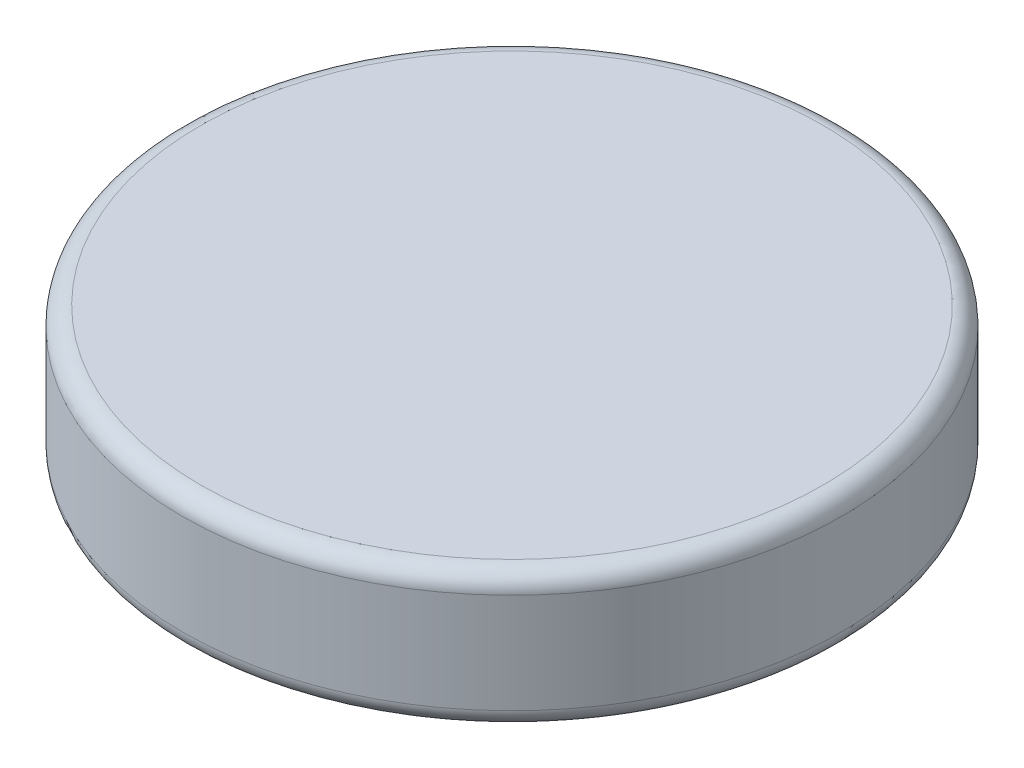
ISO-10303-21;
HEADER;
FILE_DESCRIPTION(('STEP AP214'),'2;1');
FILE_NAME('part.step','',(''),(''),'','','');
FILE_SCHEMA(('AUTOMOTIVE_DESIGN { 1 0 10303 214 1 1 1 1 }'));
ENDSEC;
DATA;
#1=APPLICATION_CONTEXT('core data for automotive mechanical design processes');
#2=APPLICATION_PROTOCOL_DEFINITION('international standard','automotive_design',2000,#1);
#3=PRODUCT_CONTEXT('',#1,'mechanical');
#4=PRODUCT('Part','Part','',(#3));
#5=PRODUCT_RELATED_PRODUCT_CATEGORY('part','',(#4));
#6=PRODUCT_DEFINITION_FORMATION('','',#4);
#7=PRODUCT_DEFINITION_CONTEXT('part definition',#1,'design');
#8=PRODUCT_DEFINITION('design','',#6,#7);
#9=PRODUCT_DEFINITION_SHAPE('','',#8);
#10=(LENGTH_UNIT() NAMED_UNIT(*) SI_UNIT(.MILLI.,.METRE.));
#11=(NAMED_UNIT(*) PLANE_ANGLE_UNIT() SI_UNIT($,.RADIAN.));
#12=(NAMED_UNIT(*) SI_UNIT($,.STERADIAN.) SOLID_ANGLE_UNIT());
#13=UNCERTAINTY_MEASURE_WITH_UNIT(LENGTH_MEASURE(1.E-05),#10,'distance_accuracy_value','');
#14=(GEOMETRIC_REPRESENTATION_CONTEXT(3) GLOBAL_UNCERTAINTY_ASSIGNED_CONTEXT((#13)) GLOBAL_UNIT_ASSIGNED_CONTEXT((#10,
#11,#12)) REPRESENTATION_CONTEXT('',''));
#15=CARTESIAN_POINT('',(0.,0.,0.));
#16=DIRECTION('',(0.,0.,1.));
#17=DIRECTION('',(1.,0.,0.));
#18=AXIS2_PLACEMENT_3D('',#15,#16,#17);
#19=CARTESIAN_POINT('',(0.,76.2,0.));
#20=DIRECTION('',(0.,-1.,0.));
#21=DIRECTION('',(0.,0.,-1.));
#22=AXIS2_PLACEMENT_3D('',#19,#20,#21);
#23=CYLINDRICAL_SURFACE('',#22,184.15);
#24=CARTESIAN_POINT('',(0.,10.16,0.));
#25=DIRECTION('',(0.,1.,0.));
#26=DIRECTION('',(0.,0.,1.));
#27=AXIS2_PLACEMENT_3D('',#24,#25,#26);
#28=CIRCLE('',#27,184.15);
#29=CARTESIAN_POINT('',(0.,10.16,184.15));
#30=VERTEX_POINT('',#29);
#31=EDGE_CURVE('E50',#30,#30,#28,.T.);
#32=ORIENTED_EDGE('',*,*,#31,.T.);
#33=EDGE_LOOP('',(#32));
#34=FACE_BOUND('',#33,.T.);
#35=CARTESIAN_POINT('',(0.,66.04,0.));
#36=DIRECTION('',(0.,1.,0.));
#37=DIRECTION('',(0.,0.,1.));
#38=AXIS2_PLACEMENT_3D('',#35,#36,#37);
#39=CIRCLE('',#38,184.15);
#40=CARTESIAN_POINT('',(0.,66.04,184.15));
#41=VERTEX_POINT('',#40);
#42=EDGE_CURVE('E55',#41,#41,#39,.F.);
#43=ORIENTED_EDGE('',*,*,#42,.T.);
#44=EDGE_LOOP('',(#43));
#45=FACE_BOUND('',#44,.T.);
#46=ADVANCED_FACE('F37',(#34,#45),#23,.T.);
#47=CARTESIAN_POINT('',(0.,76.2,0.));
#48=DIRECTION('',(0.,1.,0.));
#49=DIRECTION('',(0.,0.,1.));
#50=AXIS2_PLACEMENT_3D('',#47,#48,#49);
#51=PLANE('',#50);
#52=CARTESIAN_POINT('',(0.,76.2,0.));
#53=DIRECTION('',(0.,1.,0.));
#54=DIRECTION('',(0.,0.,1.));
#55=AXIS2_PLACEMENT_3D('',#52,#53,#54);
#56=CIRCLE('',#55,173.99);
#57=CARTESIAN_POINT('',(0.,76.2,173.99));
#58=VERTEX_POINT('',#57);
#59=EDGE_CURVE('E10',#58,#58,#56,.T.);
#60=ORIENTED_EDGE('',*,*,#59,.T.);
#61=EDGE_LOOP('',(#60));
#62=FACE_BOUND('',#61,.T.);
#63=ADVANCED_FACE('F72',(#62),#51,.T.);
#64=CARTESIAN_POINT('',(0.,0.,0.));
#65=DIRECTION('',(0.,1.,0.));
#66=DIRECTION('',(0.,0.,1.));
#67=AXIS2_PLACEMENT_3D('',#64,#65,#66);
#68=PLANE('',#67);
#69=CARTESIAN_POINT('',(0.,0.,0.));
#70=DIRECTION('',(0.,1.,0.));
#71=DIRECTION('',(0.,0.,1.));
#72=AXIS2_PLACEMENT_3D('',#69,#70,#71);
#73=CIRCLE('',#72,173.99);
#74=CARTESIAN_POINT('',(0.,0.,173.99));
#75=VERTEX_POINT('',#74);
#76=EDGE_CURVE('E45',#75,#75,#73,.F.);
#77=ORIENTED_EDGE('',*,*,#76,.T.);
#78=EDGE_LOOP('',(#77));
#79=FACE_BOUND('',#78,.T.);
#80=ADVANCED_FACE('F69',(#79),#68,.F.);
#81=CARTESIAN_POINT('',(0.,10.16,0.));
#82=DIRECTION('',(0.,1.,0.));
#83=DIRECTION('',(0.,0.,1.));
#84=AXIS2_PLACEMENT_3D('',#81,#82,#83);
#85=TOROIDAL_SURFACE('',#84,173.99,10.16);
#86=ORIENTED_EDGE('',*,*,#76,.F.);
#87=EDGE_LOOP('',(#86));
#88=FACE_BOUND('',#87,.T.);
#89=ORIENTED_EDGE('',*,*,#31,.F.);
#90=EDGE_LOOP('',(#89));
#91=FACE_BOUND('',#90,.T.);
#92=ADVANCED_FACE('F65',(#88,#91),#85,.T.);
#93=CARTESIAN_POINT('',(0.,66.04,0.));
#94=DIRECTION('',(0.,1.,0.));
#95=DIRECTION('',(0.,0.,1.));
#96=AXIS2_PLACEMENT_3D('',#93,#94,#95);
#97=TOROIDAL_SURFACE('',#96,173.99,10.16);
#98=ORIENTED_EDGE('',*,*,#42,.F.);
#99=EDGE_LOOP('',(#98));
#100=FACE_BOUND('',#99,.T.);
#101=ORIENTED_EDGE('',*,*,#59,.F.);
#102=EDGE_LOOP('',(#101));
#103=FACE_BOUND('',#102,.T.);
#104=ADVANCED_FACE('F39',(#100,#103),#97,.T.);
#105=CLOSED_SHELL('',(#46,#63,#80,#92,#104));
#106=MANIFOLD_SOLID_BREP('B2',#105);
#107=ADVANCED_BREP_SHAPE_REPRESENTATION('',(#18,#106),#14);
#108=SHAPE_DEFINITION_REPRESENTATION(#9,#107);
ENDSEC;
END-ISO-10303-21;
